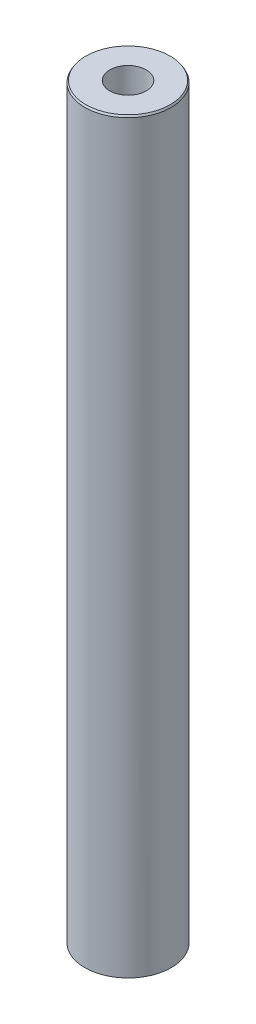
ISO-10303-21;
HEADER;
FILE_DESCRIPTION(('STEP AP214'),'2;1');
FILE_NAME('part.step','',(''),(''),'','','');
FILE_SCHEMA(('AUTOMOTIVE_DESIGN { 1 0 10303 214 1 1 1 1 }'));
ENDSEC;
DATA;
#1=APPLICATION_CONTEXT('core data for automotive mechanical design processes');
#2=APPLICATION_PROTOCOL_DEFINITION('international standard','automotive_design',2000,#1);
#3=PRODUCT_CONTEXT('',#1,'mechanical');
#4=PRODUCT('Part','Part','',(#3));
#5=PRODUCT_RELATED_PRODUCT_CATEGORY('part','',(#4));
#6=PRODUCT_DEFINITION_FORMATION('','',#4);
#7=PRODUCT_DEFINITION_CONTEXT('part definition',#1,'design');
#8=PRODUCT_DEFINITION('design','',#6,#7);
#9=PRODUCT_DEFINITION_SHAPE('','',#8);
#10=(LENGTH_UNIT() NAMED_UNIT(*) SI_UNIT(.MILLI.,.METRE.));
#11=(NAMED_UNIT(*) PLANE_ANGLE_UNIT() SI_UNIT($,.RADIAN.));
#12=(NAMED_UNIT(*) SI_UNIT($,.STERADIAN.) SOLID_ANGLE_UNIT());
#13=UNCERTAINTY_MEASURE_WITH_UNIT(LENGTH_MEASURE(1.E-05),#10,'distance_accuracy_value','');
#14=(GEOMETRIC_REPRESENTATION_CONTEXT(3) GLOBAL_UNCERTAINTY_ASSIGNED_CONTEXT((#13)) GLOBAL_UNIT_ASSIGNED_CONTEXT((#10,
#11,#12)) REPRESENTATION_CONTEXT('',''));
#15=CARTESIAN_POINT('',(0.,0.,0.));
#16=DIRECTION('',(0.,0.,1.));
#17=DIRECTION('',(1.,0.,0.));
#18=AXIS2_PLACEMENT_3D('',#15,#16,#17);
#19=CARTESIAN_POINT('',(0.,86.5351599859905,0.));
#20=DIRECTION('',(0.,-1.,0.));
#21=DIRECTION('',(0.,0.,-1.));
#22=AXIS2_PLACEMENT_3D('',#19,#20,#21);
#23=CYLINDRICAL_SURFACE('',#22,5.);
#24=CARTESIAN_POINT('',(0.,86.3231985749671,0.));
#25=DIRECTION('',(0.,1.,0.));
#26=DIRECTION('',(0.,0.,1.));
#27=AXIS2_PLACEMENT_3D('',#24,#25,#26);
#28=CIRCLE('',#27,5.);
#29=CARTESIAN_POINT('',(0.,86.3231985749671,-5.));
#30=VERTEX_POINT('',#29);
#31=EDGE_CURVE('E50',#30,#30,#28,.F.);
#32=CARTESIAN_POINT('',(0.,0.122375977712266,0.));
#33=DIRECTION('',(0.,1.,0.));
#34=DIRECTION('',(0.,0.,1.));
#35=AXIS2_PLACEMENT_3D('',#32,#33,#34);
#36=CIRCLE('',#35,5.);
#37=CARTESIAN_POINT('',(0.,0.122375977712266,-5.));
#38=VERTEX_POINT('',#37);
#39=EDGE_CURVE('E51',#38,#38,#36,.T.);
#40=CARTESIAN_POINT('',(0.,86.3231985749671,-5.));
#41=CARTESIAN_POINT('',(0.,85.425273339579,-5.));
#42=CARTESIAN_POINT('',(0.,84.5273481041909,-5.));
#43=CARTESIAN_POINT('',(0.,82.7314976334148,-5.));
#44=CARTESIAN_POINT('',(0.,81.8335723980267,-5.));
#45=CARTESIAN_POINT('',(0.,80.0377219272506,-5.));
#46=CARTESIAN_POINT('',(0.,79.1397966918625,-5.));
#47=CARTESIAN_POINT('',(0.,77.3439462210864,-5.));
#48=CARTESIAN_POINT('',(0.,76.4460209856983,-5.));
#49=CARTESIAN_POINT('',(0.,74.6501705149221,-5.));
#50=CARTESIAN_POINT('',(0.,73.7522452795341,-5.));
#51=CARTESIAN_POINT('',(0.,71.9563948087579,-5.));
#52=CARTESIAN_POINT('',(0.,71.0584695733698,-5.));
#53=CARTESIAN_POINT('',(0.,69.2626191025937,-5.));
#54=CARTESIAN_POINT('',(0.,68.3646938672056,-5.));
#55=CARTESIAN_POINT('',(0.,66.5688433964295,-5.));
#56=CARTESIAN_POINT('',(0.,65.6709181610414,-5.));
#57=CARTESIAN_POINT('',(0.,63.8750676902653,-5.));
#58=CARTESIAN_POINT('',(0.,62.9771424548772,-5.));
#59=CARTESIAN_POINT('',(0.,61.1812919841011,-5.));
#60=CARTESIAN_POINT('',(0.,60.283366748713,-5.));
#61=CARTESIAN_POINT('',(0.,58.4875162779369,-5.));
#62=CARTESIAN_POINT('',(0.,57.5895910425488,-5.));
#63=CARTESIAN_POINT('',(0.,55.7937405717727,-5.));
#64=CARTESIAN_POINT('',(0.,54.8958153363846,-5.));
#65=CARTESIAN_POINT('',(0.,53.0999648656084,-5.));
#66=CARTESIAN_POINT('',(0.,52.2020396302204,-5.));
#67=CARTESIAN_POINT('',(0.,50.4061891594442,-5.));
#68=CARTESIAN_POINT('',(0.,49.5082639240562,-5.));
#69=CARTESIAN_POINT('',(0.,47.71241345328,-5.));
#70=CARTESIAN_POINT('',(0.,46.8144882178919,-5.));
#71=CARTESIAN_POINT('',(0.,45.0186377471158,-5.));
#72=CARTESIAN_POINT('',(0.,44.1207125117277,-5.));
#73=CARTESIAN_POINT('',(0.,42.3248620409516,-5.));
#74=CARTESIAN_POINT('',(0.,41.4269368055635,-5.));
#75=CARTESIAN_POINT('',(0.,39.6310863347874,-5.));
#76=CARTESIAN_POINT('',(0.,38.7331610993993,-5.));
#77=CARTESIAN_POINT('',(0.,36.9373106286232,-5.));
#78=CARTESIAN_POINT('',(0.,36.0393853932351,-5.));
#79=CARTESIAN_POINT('',(0.,34.243534922459,-5.));
#80=CARTESIAN_POINT('',(0.,33.3456096870709,-5.));
#81=CARTESIAN_POINT('',(0.,31.5497592162947,-5.));
#82=CARTESIAN_POINT('',(0.,30.6518339809067,-5.));
#83=CARTESIAN_POINT('',(0.,28.8559835101305,-5.));
#84=CARTESIAN_POINT('',(0.,27.9580582747425,-5.));
#85=CARTESIAN_POINT('',(0.,26.1622078039663,-5.));
#86=CARTESIAN_POINT('',(0.,25.2642825685782,-5.));
#87=CARTESIAN_POINT('',(0.,23.4684320978021,-5.));
#88=CARTESIAN_POINT('',(0.,22.570506862414,-5.));
#89=CARTESIAN_POINT('',(0.,20.7746563916379,-5.));
#90=CARTESIAN_POINT('',(0.,19.8767311562498,-5.));
#91=CARTESIAN_POINT('',(0.,18.0808806854737,-5.));
#92=CARTESIAN_POINT('',(0.,17.1829554500856,-5.));
#93=CARTESIAN_POINT('',(0.,15.3871049793095,-5.));
#94=CARTESIAN_POINT('',(0.,14.4891797439214,-5.));
#95=CARTESIAN_POINT('',(0.,12.6933292731453,-5.));
#96=CARTESIAN_POINT('',(0.,11.7954040377572,-5.));
#97=CARTESIAN_POINT('',(0.,9.99955356698105,-5.));
#98=CARTESIAN_POINT('',(0.,9.10162833159297,-5.));
#99=CARTESIAN_POINT('',(0.,7.30577786081683,-5.));
#100=CARTESIAN_POINT('',(0.,6.40785262542876,-5.));
#101=CARTESIAN_POINT('',(0.,4.61200215465262,-5.));
#102=CARTESIAN_POINT('',(0.,3.71407691926455,-5.));
#103=CARTESIAN_POINT('',(0.,1.9182264484884,-5.));
#104=CARTESIAN_POINT('',(0.,1.02030121310034,-5.));
#105=CARTESIAN_POINT('',(0.,0.122375977712266,-5.));
#106=B_SPLINE_CURVE_WITH_KNOTS('',3,(#40,#41,#42,#43,#44,#45,#46,#47,#48,#49,#50,#51,#52,#53,
#54,#55,#56,#57,#58,#59,#60,#61,#62,#63,#64,#65,#66,#67,#68,#69,#70,#71,#72,#73,#74,#75,#76,#77,
#78,#79,#80,#81,#82,#83,#84,#85,#86,#87,#88,#89,#90,#91,#92,#93,#94,#95,#96,#97,#98,#99,#100,
#101,#102,#103,#104,#105),.UNSPECIFIED.,.F.,.F.,(4,2,2,2,2,2,2,2,2,2,2,2,2,2,2,2,2,2,2,2,2,2,2,
2,2,2,2,2,2,2,2,2,4),(0.,2.69377570616421,5.38755141232841,8.08132711849263,10.7751028246568,
13.4688785308211,16.1626542369853,18.8564299431495,21.5502056493137,24.2439813554779,
26.9377570616421,29.6315327678063,32.3253084739705,35.0190841801347,37.712859886299,
40.4066355924632,43.1004112986274,45.7941870047916,48.4879627109558,51.18173841712,
53.8755141232842,56.5692898294485,59.2630655356127,61.9568412417769,64.6506169479411,
67.3443926541053,70.0381683602695,72.7319440664337,75.4257197725979,78.1194954787621,
80.8132711849264,83.5070468910906,86.2008225972548),.UNSPECIFIED.);
#107=EDGE_CURVE('BSEAM39',#30,#38,#106,.T.);
#108=ORIENTED_EDGE('',*,*,#31,.T.);
#109=ORIENTED_EDGE('',*,*,#39,.T.);
#110=ORIENTED_EDGE('',*,*,#107,.T.);
#111=ORIENTED_EDGE('',*,*,#107,.F.);
#112=EDGE_LOOP('',(#108,#110,#109,#111));
#113=FACE_BOUND('',#112,.T.);
#114=ADVANCED_FACE('F39',(#113),#23,.T.);
#115=CARTESIAN_POINT('',(0.,86.5351599859905,0.));
#116=DIRECTION('',(0.,1.,0.));
#117=DIRECTION('',(0.,0.,1.));
#118=AXIS2_PLACEMENT_3D('',#115,#116,#117);
#119=PLANE('',#118);
#120=CARTESIAN_POINT('',(0.,86.5351599859905,0.));
#121=DIRECTION('',(0.,1.,0.));
#122=DIRECTION('',(0.,0.,1.));
#123=AXIS2_PLACEMENT_3D('',#120,#121,#122);
#124=CIRCLE('',#123,4.87762402228782);
#125=CARTESIAN_POINT('',(0.,86.5351599859905,4.87762402228782));
#126=VERTEX_POINT('',#125);
#127=EDGE_CURVE('E54',#126,#126,#124,.T.);
#128=ORIENTED_EDGE('',*,*,#127,.T.);
#129=EDGE_LOOP('',(#128));
#130=FACE_BOUND('',#129,.T.);
#131=CARTESIAN_POINT('',(0.,86.5351599859905,0.));
#132=DIRECTION('',(0.,1.,0.));
#133=DIRECTION('',(0.,0.,1.));
#134=AXIS2_PLACEMENT_3D('',#131,#132,#133);
#135=CIRCLE('',#134,2.11104334753198);
#136=CARTESIAN_POINT('',(0.,86.5351599859905,-2.11104334753198));
#137=VERTEX_POINT('',#136);
#138=EDGE_CURVE('E58',#137,#137,#135,.T.);
#139=ORIENTED_EDGE('',*,*,#138,.F.);
#140=EDGE_LOOP('',(#139));
#141=FACE_BOUND('',#140,.T.);
#142=ADVANCED_FACE('F69',(#130,#141),#119,.T.);
#143=CARTESIAN_POINT('',(0.,0.,0.));
#144=DIRECTION('',(0.,1.,0.));
#145=DIRECTION('',(0.,0.,1.));
#146=AXIS2_PLACEMENT_3D('',#143,#144,#145);
#147=PLANE('',#146);
#148=CARTESIAN_POINT('',(0.,0.,0.));
#149=DIRECTION('',(0.,1.,0.));
#150=DIRECTION('',(0.,0.,1.));
#151=AXIS2_PLACEMENT_3D('',#148,#149,#150);
#152=CIRCLE('',#151,4.78803858897646);
#153=CARTESIAN_POINT('',(0.,0.,4.78803858897646));
#154=VERTEX_POINT('',#153);
#155=EDGE_CURVE('E10',#154,#154,#152,.F.);
#156=ORIENTED_EDGE('',*,*,#155,.T.);
#157=EDGE_LOOP('',(#156));
#158=FACE_BOUND('',#157,.T.);
#159=CARTESIAN_POINT('',(0.,0.,0.));
#160=DIRECTION('',(0.,1.,0.));
#161=DIRECTION('',(0.,0.,1.));
#162=AXIS2_PLACEMENT_3D('',#159,#160,#161);
#163=CIRCLE('',#162,2.11104334753198);
#164=CARTESIAN_POINT('',(0.,0.,-2.11104334753198));
#165=VERTEX_POINT('',#164);
#166=EDGE_CURVE('E63',#165,#165,#163,.T.);
#167=ORIENTED_EDGE('',*,*,#166,.T.);
#168=EDGE_LOOP('',(#167));
#169=FACE_BOUND('',#168,.T.);
#170=ADVANCED_FACE('F75',(#158,#169),#147,.F.);
#171=CARTESIAN_POINT('',(0.,86.5351599859905,0.));
#172=DIRECTION('',(0.,-1.,0.));
#173=DIRECTION('',(0.,0.,-1.));
#174=AXIS2_PLACEMENT_3D('',#171,#172,#173);
#175=CYLINDRICAL_SURFACE('',#174,2.11104334753198);
#176=CARTESIAN_POINT('',(0.,86.5351599859905,-2.11104334753198));
#177=CARTESIAN_POINT('',(0.,85.6337520694697,-2.11104334753198));
#178=CARTESIAN_POINT('',(0.,84.732344152949,-2.11104334753198));
#179=CARTESIAN_POINT('',(0.,82.9295283199075,-2.11104334753198));
#180=CARTESIAN_POINT('',(0.,82.0281204033868,-2.11104334753198));
#181=CARTESIAN_POINT('',(0.,80.2253045703453,-2.11104334753198));
#182=CARTESIAN_POINT('',(0.,79.3238966538246,-2.11104334753198));
#183=CARTESIAN_POINT('',(0.,77.5210808207831,-2.11104334753198));
#184=CARTESIAN_POINT('',(0.,76.6196729042624,-2.11104334753198));
#185=CARTESIAN_POINT('',(0.,74.8168570712209,-2.11104334753198));
#186=CARTESIAN_POINT('',(0.,73.9154491547002,-2.11104334753198));
#187=CARTESIAN_POINT('',(0.,72.1126333216587,-2.11104334753198));
#188=CARTESIAN_POINT('',(0.,71.211225405138,-2.11104334753198));
#189=CARTESIAN_POINT('',(0.,69.4084095720965,-2.11104334753198));
#190=CARTESIAN_POINT('',(0.,68.5070016555758,-2.11104334753198));
#191=CARTESIAN_POINT('',(0.,66.7041858225343,-2.11104334753198));
#192=CARTESIAN_POINT('',(0.,65.8027779060136,-2.11104334753198));
#193=CARTESIAN_POINT('',(0.,63.9999620729721,-2.11104334753198));
#194=CARTESIAN_POINT('',(0.,63.0985541564514,-2.11104334753198));
#195=CARTESIAN_POINT('',(0.,61.2957383234099,-2.11104334753198));
#196=CARTESIAN_POINT('',(0.,60.3943304068892,-2.11104334753198));
#197=CARTESIAN_POINT('',(0.,58.5915145738477,-2.11104334753198));
#198=CARTESIAN_POINT('',(0.,57.690106657327,-2.11104334753198));
#199=CARTESIAN_POINT('',(0.,55.8872908242855,-2.11104334753198));
#200=CARTESIAN_POINT('',(0.,54.9858829077648,-2.11104334753198));
#201=CARTESIAN_POINT('',(0.,53.1830670747233,-2.11104334753198));
#202=CARTESIAN_POINT('',(0.,52.2816591582026,-2.11104334753198));
#203=CARTESIAN_POINT('',(0.,50.4788433251611,-2.11104334753198));
#204=CARTESIAN_POINT('',(0.,49.5774354086404,-2.11104334753198));
#205=CARTESIAN_POINT('',(0.,47.7746195755989,-2.11104334753198));
#206=CARTESIAN_POINT('',(0.,46.8732116590782,-2.11104334753198));
#207=CARTESIAN_POINT('',(0.,45.0703958260367,-2.11104334753198));
#208=CARTESIAN_POINT('',(0.,44.168987909516,-2.11104334753198));
#209=CARTESIAN_POINT('',(0.,42.3661720764745,-2.11104334753198));
#210=CARTESIAN_POINT('',(0.,41.4647641599538,-2.11104334753198));
#211=CARTESIAN_POINT('',(0.,39.6619483269123,-2.11104334753198));
#212=CARTESIAN_POINT('',(0.,38.7605404103916,-2.11104334753198));
#213=CARTESIAN_POINT('',(0.,36.9577245773501,-2.11104334753198));
#214=CARTESIAN_POINT('',(0.,36.0563166608294,-2.11104334753198));
#215=CARTESIAN_POINT('',(0.,34.2535008277879,-2.11104334753198));
#216=CARTESIAN_POINT('',(0.,33.3520929112671,-2.11104334753198));
#217=CARTESIAN_POINT('',(0.,31.5492770782257,-2.11104334753198));
#218=CARTESIAN_POINT('',(0.,30.6478691617049,-2.11104334753198));
#219=CARTESIAN_POINT('',(0.,28.8450533286635,-2.11104334753198));
#220=CARTESIAN_POINT('',(0.,27.9436454121427,-2.11104334753198));
#221=CARTESIAN_POINT('',(0.,26.1408295791013,-2.11104334753198));
#222=CARTESIAN_POINT('',(0.,25.2394216625805,-2.11104334753198));
#223=CARTESIAN_POINT('',(0.,23.4366058295391,-2.11104334753198));
#224=CARTESIAN_POINT('',(0.,22.5351979130183,-2.11104334753198));
#225=CARTESIAN_POINT('',(0.,20.7323820799769,-2.11104334753198));
#226=CARTESIAN_POINT('',(0.,19.8309741634561,-2.11104334753198));
#227=CARTESIAN_POINT('',(0.,18.0281583304147,-2.11104334753198));
#228=CARTESIAN_POINT('',(0.,17.1267504138939,-2.11104334753198));
#229=CARTESIAN_POINT('',(0.,15.3239345808525,-2.11104334753198));
#230=CARTESIAN_POINT('',(0.,14.4225266643317,-2.11104334753198));
#231=CARTESIAN_POINT('',(0.,12.6197108312903,-2.11104334753198));
#232=CARTESIAN_POINT('',(0.,11.7183029147695,-2.11104334753198));
#233=CARTESIAN_POINT('',(0.,9.91548708172806,-2.11104334753198));
#234=CARTESIAN_POINT('',(0.,9.01407916520733,-2.11104334753198));
#235=CARTESIAN_POINT('',(0.,7.21126333216586,-2.11104334753198));
#236=CARTESIAN_POINT('',(0.,6.30985541564513,-2.11104334753198));
#237=CARTESIAN_POINT('',(0.,4.50703958260366,-2.11104334753198));
#238=CARTESIAN_POINT('',(0.,3.60563166608293,-2.11104334753198));
#239=CARTESIAN_POINT('',(0.,1.80281583304146,-2.11104334753198));
#240=CARTESIAN_POINT('',(0.,0.901407916520721,-2.11104334753198));
#241=CARTESIAN_POINT('',(0.,0.,-2.11104334753198));
#242=B_SPLINE_CURVE_WITH_KNOTS('',3,(#176,#177,#178,#179,#180,#181,#182,#183,#184,#185,#186,
#187,#188,#189,#190,#191,#192,#193,#194,#195,#196,#197,#198,#199,#200,#201,#202,#203,#204,#205,
#206,#207,#208,#209,#210,#211,#212,#213,#214,#215,#216,#217,#218,#219,#220,#221,#222,#223,#224,
#225,#226,#227,#228,#229,#230,#231,#232,#233,#234,#235,#236,#237,#238,#239,#240,#241),
.UNSPECIFIED.,.F.,.F.,(4,2,2,2,2,2,2,2,2,2,2,2,2,2,2,2,2,2,2,2,2,2,2,2,2,2,2,2,2,2,2,2,4),(0.,
2.70422374956221,5.40844749912442,8.11267124868662,10.8168949982488,13.521118747811,
16.2253424973732,18.9295662469354,21.6337899964976,24.3380137460598,27.042237495622,
29.7464612451842,32.4506849947464,35.1549087443086,37.8591324938709,40.5633562434331,
43.2675799929953,45.9718037425575,48.6760274921197,51.3802512416819,54.0844749912441,
56.7886987408063,59.4929224903685,62.1971462399307,64.9013699894929,67.6055937390551,
70.3098174886173,73.0140412381795,75.7182649877417,78.4224887373039,81.1267124868661,
83.8309362364283,86.5351599859905),.UNSPECIFIED.);
#243=EDGE_CURVE('BSEAM70',#137,#165,#242,.T.);
#244=ORIENTED_EDGE('',*,*,#138,.T.);
#245=ORIENTED_EDGE('',*,*,#166,.F.);
#246=ORIENTED_EDGE('',*,*,#243,.T.);
#247=ORIENTED_EDGE('',*,*,#243,.F.);
#248=EDGE_LOOP('',(#244,#246,#245,#247));
#249=FACE_BOUND('',#248,.T.);
#250=ADVANCED_FACE('F70',(#249),#175,.F.);
#251=CARTESIAN_POINT('',(0.,86.5351599859905,0.));
#252=DIRECTION('',(0.,-1.,0.));
#253=DIRECTION('',(0.,0.,-1.));
#254=AXIS2_PLACEMENT_3D('',#251,#252,#253);
#255=CONICAL_SURFACE('',#254,4.87762402228782,0.523598775598278);
#256=ORIENTED_EDGE('',*,*,#31,.F.);
#257=EDGE_LOOP('',(#256));
#258=FACE_BOUND('',#257,.T.);
#259=ORIENTED_EDGE('',*,*,#127,.F.);
#260=EDGE_LOOP('',(#259));
#261=FACE_BOUND('',#260,.T.);
#262=ADVANCED_FACE('F81',(#258,#261),#255,.T.);
#263=CARTESIAN_POINT('',(0.,0.122375977712266,0.));
#264=DIRECTION('',(0.,1.,0.));
#265=DIRECTION('',(0.,0.,1.));
#266=AXIS2_PLACEMENT_3D('',#263,#264,#265);
#267=CONICAL_SURFACE('',#266,5.,1.04719755119655);
#268=ORIENTED_EDGE('',*,*,#155,.F.);
#269=EDGE_LOOP('',(#268));
#270=FACE_BOUND('',#269,.T.);
#271=ORIENTED_EDGE('',*,*,#39,.F.);
#272=EDGE_LOOP('',(#271));
#273=FACE_BOUND('',#272,.T.);
#274=ADVANCED_FACE('F45',(#270,#273),#267,.T.);
#275=CLOSED_SHELL('',(#114,#142,#170,#250,#262,#274));
#276=MANIFOLD_SOLID_BREP('B2',#275);
#277=ADVANCED_BREP_SHAPE_REPRESENTATION('',(#18,#276),#14);
#278=SHAPE_DEFINITION_REPRESENTATION(#9,#277);
ENDSEC;
END-ISO-10303-21;
